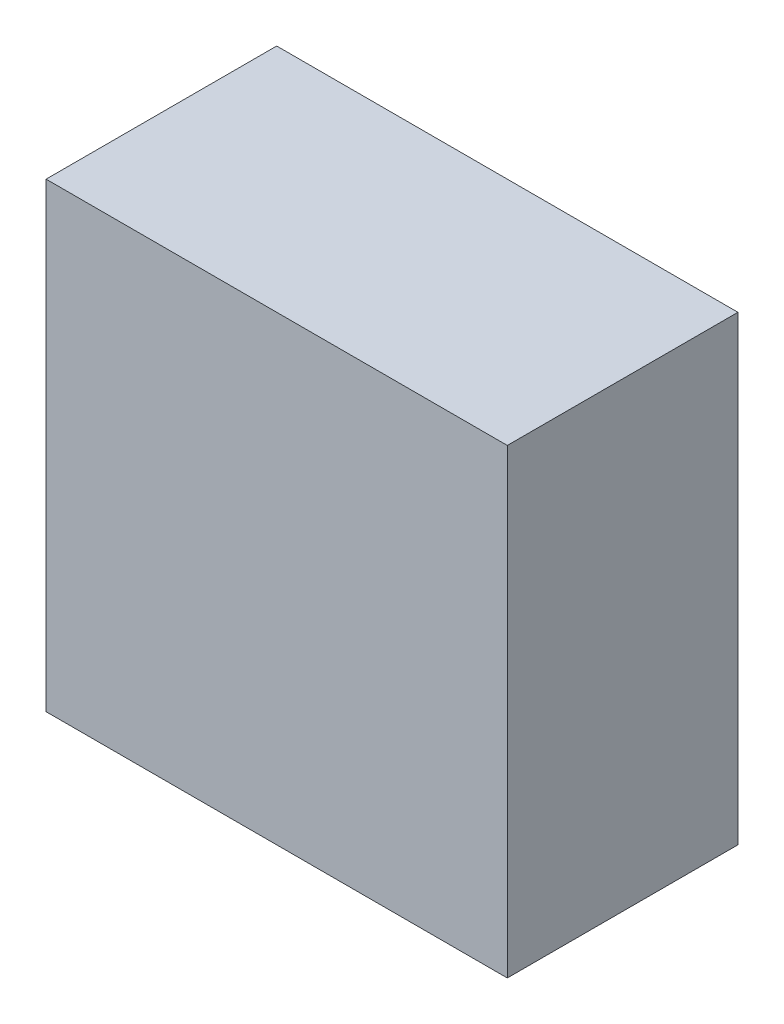
ISO-10303-21;
HEADER;
FILE_DESCRIPTION(('STEP AP214'),'2;1');
FILE_NAME('part.step','',(''),(''),'','','');
FILE_SCHEMA(('AUTOMOTIVE_DESIGN { 1 0 10303 214 1 1 1 1 }'));
ENDSEC;
DATA;
#1=APPLICATION_CONTEXT('core data for automotive mechanical design processes');
#2=APPLICATION_PROTOCOL_DEFINITION('international standard','automotive_design',2000,#1);
#3=PRODUCT_CONTEXT('',#1,'mechanical');
#4=PRODUCT('Part','Part','',(#3));
#5=PRODUCT_RELATED_PRODUCT_CATEGORY('part','',(#4));
#6=PRODUCT_DEFINITION_FORMATION('','',#4);
#7=PRODUCT_DEFINITION_CONTEXT('part definition',#1,'design');
#8=PRODUCT_DEFINITION('design','',#6,#7);
#9=PRODUCT_DEFINITION_SHAPE('','',#8);
#10=(LENGTH_UNIT() NAMED_UNIT(*) SI_UNIT(.MILLI.,.METRE.));
#11=(NAMED_UNIT(*) PLANE_ANGLE_UNIT() SI_UNIT($,.RADIAN.));
#12=(NAMED_UNIT(*) SI_UNIT($,.STERADIAN.) SOLID_ANGLE_UNIT());
#13=UNCERTAINTY_MEASURE_WITH_UNIT(LENGTH_MEASURE(1.E-05),#10,'distance_accuracy_value','');
#14=(GEOMETRIC_REPRESENTATION_CONTEXT(3) GLOBAL_UNCERTAINTY_ASSIGNED_CONTEXT((#13)) GLOBAL_UNIT_ASSIGNED_CONTEXT((#10,
#11,#12)) REPRESENTATION_CONTEXT('',''));
#15=CARTESIAN_POINT('',(0.,0.,0.));
#16=DIRECTION('',(0.,0.,1.));
#17=DIRECTION('',(1.,0.,0.));
#18=AXIS2_PLACEMENT_3D('',#15,#16,#17);
#19=CARTESIAN_POINT('',(0.,0.,2.75));
#20=DIRECTION('',(0.,0.,-1.));
#21=DIRECTION('',(-1.,0.,0.));
#22=AXIS2_PLACEMENT_3D('',#19,#20,#21);
#23=PLANE('',#22);
#24=DIRECTION('',(1.,0.,0.));
#25=VECTOR('',#24,1.);
#26=CARTESIAN_POINT('',(158.313158045853,72.9291158443042,2.75));
#27=LINE('',#26,#25);
#28=CARTESIAN_POINT('',(158.313158045853,72.9291158443042,2.75));
#29=VERTEX_POINT('',#28);
#30=CARTESIAN_POINT('',(154.313158045853,72.9291158443042,2.75));
#31=VERTEX_POINT('',#30);
#32=EDGE_CURVE('E80',#29,#31,#27,.F.);
#33=ORIENTED_EDGE('',*,*,#32,.T.);
#34=DIRECTION('',(0.,1.,0.));
#35=VECTOR('',#34,1.);
#36=CARTESIAN_POINT('',(154.313158045853,72.9291158443042,2.75));
#37=LINE('',#36,#35);
#38=CARTESIAN_POINT('',(154.313158045853,68.9291158443042,2.75));
#39=VERTEX_POINT('',#38);
#40=EDGE_CURVE('E55',#31,#39,#37,.F.);
#41=ORIENTED_EDGE('',*,*,#40,.T.);
#42=DIRECTION('',(1.,0.,0.));
#43=VECTOR('',#42,1.);
#44=CARTESIAN_POINT('',(158.313158045853,68.9291158443042,2.75));
#45=LINE('',#44,#43);
#46=CARTESIAN_POINT('',(158.313158045853,68.9291158443042,2.75));
#47=VERTEX_POINT('',#46);
#48=EDGE_CURVE('E57',#39,#47,#45,.T.);
#49=ORIENTED_EDGE('',*,*,#48,.T.);
#50=DIRECTION('',(0.,1.,0.));
#51=VECTOR('',#50,1.);
#52=CARTESIAN_POINT('',(158.313158045853,72.9291158443042,2.75));
#53=LINE('',#52,#51);
#54=EDGE_CURVE('E20',#47,#29,#53,.T.);
#55=ORIENTED_EDGE('',*,*,#54,.T.);
#56=EDGE_LOOP('',(#33,#41,#49,#55));
#57=FACE_BOUND('',#56,.T.);
#58=ADVANCED_FACE('F17',(#57),#23,.F.);
#59=CARTESIAN_POINT('',(158.313158045853,72.9291158443042,2.75));
#60=DIRECTION('',(-1.,0.,0.));
#61=DIRECTION('',(0.,0.,1.));
#62=AXIS2_PLACEMENT_3D('',#59,#60,#61);
#63=PLANE('',#62);
#64=DIRECTION('',(0.,0.,-1.));
#65=VECTOR('',#64,1.);
#66=CARTESIAN_POINT('',(158.313158045853,72.9291158443042,2.75));
#67=LINE('',#66,#65);
#68=CARTESIAN_POINT('',(158.313158045853,72.9291158443042,0.75));
#69=VERTEX_POINT('',#68);
#70=EDGE_CURVE('E68',#69,#29,#67,.F.);
#71=ORIENTED_EDGE('',*,*,#70,.T.);
#72=ORIENTED_EDGE('',*,*,#54,.F.);
#73=DIRECTION('',(0.,0.,1.));
#74=VECTOR('',#73,1.);
#75=CARTESIAN_POINT('',(158.313158045853,68.9291158443042,2.75));
#76=LINE('',#75,#74);
#77=CARTESIAN_POINT('',(158.313158045853,68.9291158443042,0.75));
#78=VERTEX_POINT('',#77);
#79=EDGE_CURVE('E63',#47,#78,#76,.F.);
#80=ORIENTED_EDGE('',*,*,#79,.T.);
#81=DIRECTION('',(0.,1.,0.));
#82=VECTOR('',#81,1.);
#83=CARTESIAN_POINT('',(158.313158045853,0.,0.75));
#84=LINE('',#83,#82);
#85=EDGE_CURVE('E83',#69,#78,#84,.F.);
#86=ORIENTED_EDGE('',*,*,#85,.F.);
#87=EDGE_LOOP('',(#71,#72,#80,#86));
#88=FACE_BOUND('',#87,.T.);
#89=ADVANCED_FACE('F65',(#88),#63,.F.);
#90=CARTESIAN_POINT('',(158.313158045853,68.9291158443042,2.75));
#91=DIRECTION('',(0.,1.,0.));
#92=DIRECTION('',(0.,0.,1.));
#93=AXIS2_PLACEMENT_3D('',#90,#91,#92);
#94=PLANE('',#93);
#95=ORIENTED_EDGE('',*,*,#79,.F.);
#96=ORIENTED_EDGE('',*,*,#48,.F.);
#97=DIRECTION('',(0.,0.,-1.));
#98=VECTOR('',#97,1.);
#99=CARTESIAN_POINT('',(154.313158045853,68.9291158443042,2.75));
#100=LINE('',#99,#98);
#101=CARTESIAN_POINT('',(154.313158045853,68.9291158443042,0.75));
#102=VERTEX_POINT('',#101);
#103=EDGE_CURVE('E75',#39,#102,#100,.T.);
#104=ORIENTED_EDGE('',*,*,#103,.T.);
#105=DIRECTION('',(-1.,0.,0.));
#106=VECTOR('',#105,1.);
#107=CARTESIAN_POINT('',(0.,68.9291158443042,0.75));
#108=LINE('',#107,#106);
#109=EDGE_CURVE('E72',#78,#102,#108,.T.);
#110=ORIENTED_EDGE('',*,*,#109,.F.);
#111=EDGE_LOOP('',(#95,#96,#104,#110));
#112=FACE_BOUND('',#111,.T.);
#113=ADVANCED_FACE('F70',(#112),#94,.F.);
#114=CARTESIAN_POINT('',(154.313158045853,72.9291158443042,2.75));
#115=DIRECTION('',(1.,0.,0.));
#116=DIRECTION('',(0.,0.,-1.));
#117=AXIS2_PLACEMENT_3D('',#114,#115,#116);
#118=PLANE('',#117);
#119=ORIENTED_EDGE('',*,*,#103,.F.);
#120=ORIENTED_EDGE('',*,*,#40,.F.);
#121=DIRECTION('',(0.,0.,-1.));
#122=VECTOR('',#121,1.);
#123=CARTESIAN_POINT('',(154.313158045853,72.9291158443042,2.75));
#124=LINE('',#123,#122);
#125=CARTESIAN_POINT('',(154.313158045853,72.9291158443042,0.75));
#126=VERTEX_POINT('',#125);
#127=EDGE_CURVE('E35',#31,#126,#124,.T.);
#128=ORIENTED_EDGE('',*,*,#127,.T.);
#129=DIRECTION('',(0.,1.,0.));
#130=VECTOR('',#129,1.);
#131=CARTESIAN_POINT('',(154.313158045853,0.,0.75));
#132=LINE('',#131,#130);
#133=EDGE_CURVE('E26',#102,#126,#132,.T.);
#134=ORIENTED_EDGE('',*,*,#133,.F.);
#135=EDGE_LOOP('',(#119,#120,#128,#134));
#136=FACE_BOUND('',#135,.T.);
#137=ADVANCED_FACE('F89',(#136),#118,.F.);
#138=CARTESIAN_POINT('',(158.313158045853,72.9291158443042,2.75));
#139=DIRECTION('',(0.,-1.,0.));
#140=DIRECTION('',(0.,0.,-1.));
#141=AXIS2_PLACEMENT_3D('',#138,#139,#140);
#142=PLANE('',#141);
#143=ORIENTED_EDGE('',*,*,#127,.F.);
#144=ORIENTED_EDGE('',*,*,#32,.F.);
#145=ORIENTED_EDGE('',*,*,#70,.F.);
#146=DIRECTION('',(-1.,0.,0.));
#147=VECTOR('',#146,1.);
#148=CARTESIAN_POINT('',(0.,72.9291158443042,0.75));
#149=LINE('',#148,#147);
#150=EDGE_CURVE('E11',#126,#69,#149,.F.);
#151=ORIENTED_EDGE('',*,*,#150,.F.);
#152=EDGE_LOOP('',(#143,#144,#145,#151));
#153=FACE_BOUND('',#152,.T.);
#154=ADVANCED_FACE('F91',(#153),#142,.F.);
#155=CARTESIAN_POINT('',(0.,0.,0.75));
#156=DIRECTION('',(0.,0.,-1.));
#157=DIRECTION('',(-1.,0.,0.));
#158=AXIS2_PLACEMENT_3D('',#155,#156,#157);
#159=PLANE('',#158);
#160=ORIENTED_EDGE('',*,*,#133,.T.);
#161=ORIENTED_EDGE('',*,*,#150,.T.);
#162=ORIENTED_EDGE('',*,*,#85,.T.);
#163=ORIENTED_EDGE('',*,*,#109,.T.);
#164=EDGE_LOOP('',(#160,#161,#162,#163));
#165=FACE_BOUND('',#164,.T.);
#166=ADVANCED_FACE('F88',(#165),#159,.T.);
#167=CLOSED_SHELL('',(#58,#89,#113,#137,#154,#166));
#168=MANIFOLD_SOLID_BREP('B1',#167);
#169=ADVANCED_BREP_SHAPE_REPRESENTATION('',(#18,#168),#14);
#170=SHAPE_DEFINITION_REPRESENTATION(#9,#169);
ENDSEC;
END-ISO-10303-21;
